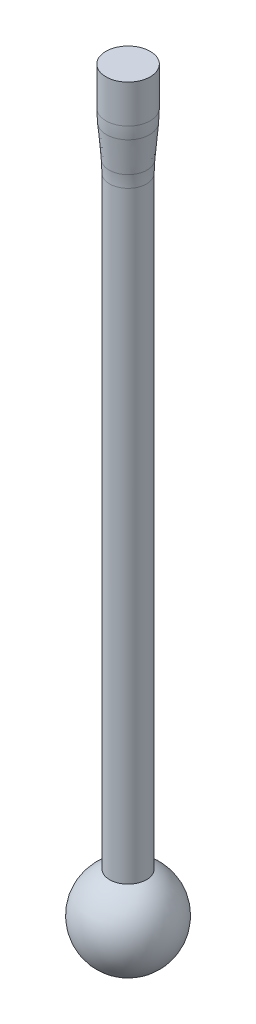
ISO-10303-21;
HEADER;
FILE_DESCRIPTION(('STEP AP214'),'2;1');
FILE_NAME('part.step','',(''),(''),'','','');
FILE_SCHEMA(('AUTOMOTIVE_DESIGN { 1 0 10303 214 1 1 1 1 }'));
ENDSEC;
DATA;
#1=APPLICATION_CONTEXT('core data for automotive mechanical design processes');
#2=APPLICATION_PROTOCOL_DEFINITION('international standard','automotive_design',2000,#1);
#3=PRODUCT_CONTEXT('',#1,'mechanical');
#4=PRODUCT('Part','Part','',(#3));
#5=PRODUCT_RELATED_PRODUCT_CATEGORY('part','',(#4));
#6=PRODUCT_DEFINITION_FORMATION('','',#4);
#7=PRODUCT_DEFINITION_CONTEXT('part definition',#1,'design');
#8=PRODUCT_DEFINITION('design','',#6,#7);
#9=PRODUCT_DEFINITION_SHAPE('','',#8);
#10=(LENGTH_UNIT() NAMED_UNIT(*) SI_UNIT(.MILLI.,.METRE.));
#11=(NAMED_UNIT(*) PLANE_ANGLE_UNIT() SI_UNIT($,.RADIAN.));
#12=(NAMED_UNIT(*) SI_UNIT($,.STERADIAN.) SOLID_ANGLE_UNIT());
#13=UNCERTAINTY_MEASURE_WITH_UNIT(LENGTH_MEASURE(1.E-05),#10,'distance_accuracy_value','');
#14=(GEOMETRIC_REPRESENTATION_CONTEXT(3) GLOBAL_UNCERTAINTY_ASSIGNED_CONTEXT((#13)) GLOBAL_UNIT_ASSIGNED_CONTEXT((#10,
#11,#12)) REPRESENTATION_CONTEXT('',''));
#15=CARTESIAN_POINT('',(0.,0.,0.));
#16=DIRECTION('',(0.,0.,1.));
#17=DIRECTION('',(1.,0.,0.));
#18=AXIS2_PLACEMENT_3D('',#15,#16,#17);
#19=CARTESIAN_POINT('',(0.,-50.,0.));
#20=DIRECTION('',(0.,-1.,0.));
#21=DIRECTION('',(-1.,0.,0.));
#22=AXIS2_PLACEMENT_3D('',#19,#20,#21);
#23=SPHERICAL_SURFACE('',#22,3.);
#24=CARTESIAN_POINT('',(1.62157550241698E-13,-47.2728219713411,0.));
#25=DIRECTION('',(0.,-1.,0.));
#26=DIRECTION('',(1.,0.,0.));
#27=AXIS2_PLACEMENT_3D('',#24,#25,#26);
#28=CIRCLE('',#27,1.24999999999984);
#29=CARTESIAN_POINT('',(1.25000000000001,-47.2728219713411,0.));
#30=VERTEX_POINT('',#29);
#31=EDGE_CURVE('E63',#30,#30,#28,.T.);
#32=ORIENTED_EDGE('',*,*,#31,.T.);
#33=EDGE_LOOP('',(#32));
#34=FACE_BOUND('',#33,.T.);
#35=ADVANCED_FACE('F43',(#34),#23,.T.);
#36=CARTESIAN_POINT('',(7.34431546370114E-13,-214.104441575138,0.));
#37=DIRECTION('',(0.,-1.,0.));
#38=DIRECTION('',(1.,0.,0.));
#39=AXIS2_PLACEMENT_3D('',#36,#37,#38);
#40=CYLINDRICAL_SURFACE('',#39,1.24999999999991);
#41=CARTESIAN_POINT('',(0.,-6.41594578792384,0.));
#42=DIRECTION('',(0.,-1.,0.));
#43=DIRECTION('',(1.,0.,0.));
#44=AXIS2_PLACEMENT_3D('',#41,#42,#43);
#45=CIRCLE('',#44,1.24999999999991);
#46=CARTESIAN_POINT('',(1.24999999999994,-6.41594578792384,0.));
#47=VERTEX_POINT('',#46);
#48=EDGE_CURVE('E58',#47,#47,#45,.T.);
#49=ORIENTED_EDGE('',*,*,#48,.T.);
#50=EDGE_LOOP('',(#49));
#51=FACE_BOUND('',#50,.T.);
#52=ORIENTED_EDGE('',*,*,#31,.F.);
#53=EDGE_LOOP('',(#52));
#54=FACE_BOUND('',#53,.T.);
#55=ADVANCED_FACE('F86',(#51,#54),#40,.T.);
#56=CARTESIAN_POINT('',(0.,-6.00000000000001,0.));
#57=DIRECTION('',(0.,1.,0.));
#58=DIRECTION('',(-1.,0.,0.));
#59=AXIS2_PLACEMENT_3D('',#56,#57,#58);
#60=CONICAL_SURFACE('',#59,1.24999999999999,0.0831412318884427);
#61=CARTESIAN_POINT('',(0.,-5.58549098938643,0.));
#62=DIRECTION('',(0.,1.,0.));
#63=DIRECTION('',(-1.,0.,0.));
#64=AXIS2_PLACEMENT_3D('',#61,#62,#63);
#65=CIRCLE('',#64,1.28454241755112);
#66=CARTESIAN_POINT('',(-1.2845424175511,-5.58549098938643,0.));
#67=VERTEX_POINT('',#66);
#68=EDGE_CURVE('E50',#67,#67,#65,.T.);
#69=ORIENTED_EDGE('',*,*,#68,.T.);
#70=EDGE_LOOP('',(#69));
#71=FACE_BOUND('',#70,.T.);
#72=CARTESIAN_POINT('',(0.,-3.41450901061438,0.));
#73=DIRECTION('',(0.,-1.,0.));
#74=DIRECTION('',(1.,0.,0.));
#75=AXIS2_PLACEMENT_3D('',#72,#73,#74);
#76=CIRCLE('',#75,1.46545758244879);
#77=CARTESIAN_POINT('',(1.4654575824488,-3.41450901061438,0.));
#78=VERTEX_POINT('',#77);
#79=EDGE_CURVE('E54',#78,#78,#76,.T.);
#80=ORIENTED_EDGE('',*,*,#79,.T.);
#81=EDGE_LOOP('',(#80));
#82=FACE_BOUND('',#81,.T.);
#83=ADVANCED_FACE('F83',(#71,#82),#60,.T.);
#84=CARTESIAN_POINT('',(7.34431546370114E-13,-214.104441575138,0.));
#85=DIRECTION('',(0.,-1.,0.));
#86=DIRECTION('',(1.,0.,0.));
#87=AXIS2_PLACEMENT_3D('',#84,#85,#86);
#88=CYLINDRICAL_SURFACE('',#87,1.49999999999999);
#89=CARTESIAN_POINT('',(0.,-2.58405421207697,0.));
#90=DIRECTION('',(0.,1.,0.));
#91=DIRECTION('',(-1.,0.,0.));
#92=AXIS2_PLACEMENT_3D('',#89,#90,#91);
#93=CIRCLE('',#92,1.49999999999999);
#94=CARTESIAN_POINT('',(-1.49999999999999,-2.58405421207697,0.));
#95=VERTEX_POINT('',#94);
#96=EDGE_CURVE('E10',#95,#95,#93,.T.);
#97=ORIENTED_EDGE('',*,*,#96,.T.);
#98=EDGE_LOOP('',(#97));
#99=FACE_BOUND('',#98,.T.);
#100=CARTESIAN_POINT('',(0.,0.,0.));
#101=DIRECTION('',(0.,-1.,0.));
#102=DIRECTION('',(1.,0.,0.));
#103=AXIS2_PLACEMENT_3D('',#100,#101,#102);
#104=CIRCLE('',#103,1.5);
#105=CARTESIAN_POINT('',(1.5,0.,0.));
#106=VERTEX_POINT('',#105);
#107=EDGE_CURVE('E66',#106,#106,#104,.T.);
#108=ORIENTED_EDGE('',*,*,#107,.T.);
#109=EDGE_LOOP('',(#108));
#110=FACE_BOUND('',#109,.T.);
#111=ADVANCED_FACE('F70',(#99,#110),#88,.T.);
#112=CARTESIAN_POINT('',(0.,0.,0.));
#113=DIRECTION('',(0.,1.,0.));
#114=DIRECTION('',(-1.,0.,0.));
#115=AXIS2_PLACEMENT_3D('',#112,#113,#114);
#116=PLANE('',#115);
#117=ORIENTED_EDGE('',*,*,#107,.F.);
#118=EDGE_LOOP('',(#117));
#119=FACE_BOUND('',#118,.T.);
#120=ADVANCED_FACE('F72',(#119),#116,.T.);
#121=CARTESIAN_POINT('',(0.,-6.41594578792384,0.));
#122=DIRECTION('',(0.,-1.,0.));
#123=DIRECTION('',(1.,0.,0.));
#124=AXIS2_PLACEMENT_3D('',#121,#122,#123);
#125=TOROIDAL_SURFACE('',#124,11.2499999999999,10.);
#126=ORIENTED_EDGE('',*,*,#68,.F.);
#127=EDGE_LOOP('',(#126));
#128=FACE_BOUND('',#127,.T.);
#129=ORIENTED_EDGE('',*,*,#48,.F.);
#130=EDGE_LOOP('',(#129));
#131=FACE_BOUND('',#130,.T.);
#132=ADVANCED_FACE('F74',(#128,#131),#125,.F.);
#133=CARTESIAN_POINT('',(0.,-2.58405421207697,0.));
#134=DIRECTION('',(0.,1.,0.));
#135=DIRECTION('',(-1.,0.,0.));
#136=AXIS2_PLACEMENT_3D('',#133,#134,#135);
#137=DEGENERATE_TOROIDAL_SURFACE('',#136,8.50000000000001,10.,.F.);
#138=ORIENTED_EDGE('',*,*,#96,.F.);
#139=EDGE_LOOP('',(#138));
#140=FACE_BOUND('',#139,.T.);
#141=ORIENTED_EDGE('',*,*,#79,.F.);
#142=EDGE_LOOP('',(#141));
#143=FACE_BOUND('',#142,.T.);
#144=ADVANCED_FACE('F45',(#140,#143),#137,.F.);
#145=CLOSED_SHELL('',(#35,#55,#83,#111,#120,#132,#144));
#146=MANIFOLD_SOLID_BREP('B2',#145);
#147=ADVANCED_BREP_SHAPE_REPRESENTATION('',(#18,#146),#14);
#148=SHAPE_DEFINITION_REPRESENTATION(#9,#147);
ENDSEC;
END-ISO-10303-21;
